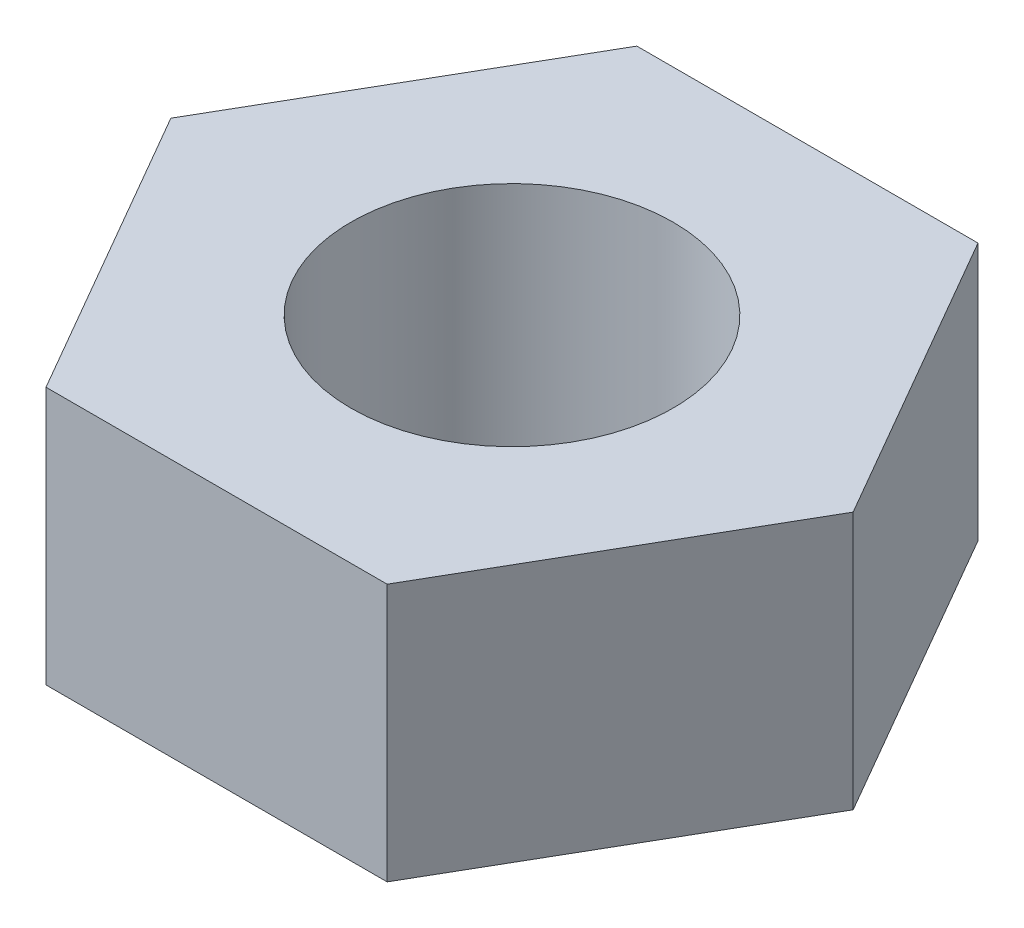
ISO-10303-21;
HEADER;
FILE_DESCRIPTION(('STEP AP214'),'2;1');
FILE_NAME('part.step','',(''),(''),'','','');
FILE_SCHEMA(('AUTOMOTIVE_DESIGN { 1 0 10303 214 1 1 1 1 }'));
ENDSEC;
DATA;
#1=APPLICATION_CONTEXT('core data for automotive mechanical design processes');
#2=APPLICATION_PROTOCOL_DEFINITION('international standard','automotive_design',2000,#1);
#3=PRODUCT_CONTEXT('',#1,'mechanical');
#4=PRODUCT('Part','Part','',(#3));
#5=PRODUCT_RELATED_PRODUCT_CATEGORY('part','',(#4));
#6=PRODUCT_DEFINITION_FORMATION('','',#4);
#7=PRODUCT_DEFINITION_CONTEXT('part definition',#1,'design');
#8=PRODUCT_DEFINITION('design','',#6,#7);
#9=PRODUCT_DEFINITION_SHAPE('','',#8);
#10=(LENGTH_UNIT() NAMED_UNIT(*) SI_UNIT(.MILLI.,.METRE.));
#11=(NAMED_UNIT(*) PLANE_ANGLE_UNIT() SI_UNIT($,.RADIAN.));
#12=(NAMED_UNIT(*) SI_UNIT($,.STERADIAN.) SOLID_ANGLE_UNIT());
#13=UNCERTAINTY_MEASURE_WITH_UNIT(LENGTH_MEASURE(1.E-05),#10,'distance_accuracy_value','');
#14=(GEOMETRIC_REPRESENTATION_CONTEXT(3) GLOBAL_UNCERTAINTY_ASSIGNED_CONTEXT((#13)) GLOBAL_UNIT_ASSIGNED_CONTEXT((#10,
#11,#12)) REPRESENTATION_CONTEXT('',''));
#15=CARTESIAN_POINT('',(0.,0.,0.));
#16=DIRECTION('',(0.,0.,1.));
#17=DIRECTION('',(1.,0.,0.));
#18=AXIS2_PLACEMENT_3D('',#15,#16,#17);
#19=CARTESIAN_POINT('',(-4.76313972081441,2.4,2.75));
#20=DIRECTION('',(0.,-1.,0.));
#21=DIRECTION('',(0.,0.,-1.));
#22=AXIS2_PLACEMENT_3D('',#19,#20,#21);
#23=PLANE('',#22);
#24=DIRECTION('',(1.,0.,0.));
#25=VECTOR('',#24,1.);
#26=CARTESIAN_POINT('',(-1.58771324027147,2.4,2.75));
#27=LINE('',#26,#25);
#28=CARTESIAN_POINT('',(-1.58771324027147,2.4,2.75));
#29=VERTEX_POINT('',#28);
#30=CARTESIAN_POINT('',(1.58771324027147,2.4,2.75));
#31=VERTEX_POINT('',#30);
#32=EDGE_CURVE('E117',#29,#31,#27,.T.);
#33=ORIENTED_EDGE('',*,*,#32,.T.);
#34=DIRECTION('',(0.5,0.,-0.866025403784439));
#35=VECTOR('',#34,1.);
#36=CARTESIAN_POINT('',(1.58771324027147,2.4,2.75));
#37=LINE('',#36,#35);
#38=CARTESIAN_POINT('',(3.17542648054294,2.4,0.));
#39=VERTEX_POINT('',#38);
#40=EDGE_CURVE('E98',#31,#39,#37,.T.);
#41=ORIENTED_EDGE('',*,*,#40,.T.);
#42=DIRECTION('',(-0.5,0.,-0.866025403784439));
#43=VECTOR('',#42,1.);
#44=CARTESIAN_POINT('',(3.17542648054294,2.4,0.));
#45=LINE('',#44,#43);
#46=CARTESIAN_POINT('',(1.58771324027147,2.4,-2.75));
#47=VERTEX_POINT('',#46);
#48=EDGE_CURVE('E120',#39,#47,#45,.T.);
#49=ORIENTED_EDGE('',*,*,#48,.T.);
#50=DIRECTION('',(-1.,0.,0.));
#51=VECTOR('',#50,1.);
#52=CARTESIAN_POINT('',(1.58771324027147,2.4,-2.75));
#53=LINE('',#52,#51);
#54=CARTESIAN_POINT('',(-1.58771324027147,2.4,-2.75));
#55=VERTEX_POINT('',#54);
#56=EDGE_CURVE('E122',#47,#55,#53,.T.);
#57=ORIENTED_EDGE('',*,*,#56,.T.);
#58=DIRECTION('',(-0.5,0.,0.866025403784439));
#59=VECTOR('',#58,1.);
#60=CARTESIAN_POINT('',(-1.58771324027147,2.4,-2.75));
#61=LINE('',#60,#59);
#62=CARTESIAN_POINT('',(-3.17542648054294,2.4,0.));
#63=VERTEX_POINT('',#62);
#64=EDGE_CURVE('E51',#55,#63,#61,.T.);
#65=ORIENTED_EDGE('',*,*,#64,.T.);
#66=DIRECTION('',(0.5,0.,0.866025403784439));
#67=VECTOR('',#66,1.);
#68=CARTESIAN_POINT('',(-3.17542648054294,2.4,0.));
#69=LINE('',#68,#67);
#70=EDGE_CURVE('E46',#63,#29,#69,.T.);
#71=ORIENTED_EDGE('',*,*,#70,.T.);
#72=EDGE_LOOP('',(#33,#41,#49,#57,#65,#71));
#73=FACE_BOUND('',#72,.T.);
#74=CARTESIAN_POINT('',(0.,2.4,0.));
#75=DIRECTION('',(0.,1.,0.));
#76=DIRECTION('',(0.,0.,1.));
#77=AXIS2_PLACEMENT_3D('',#74,#75,#76);
#78=CIRCLE('',#77,1.5);
#79=CARTESIAN_POINT('',(0.,2.4,1.5));
#80=VERTEX_POINT('',#79);
#81=EDGE_CURVE('E103',#80,#80,#78,.T.);
#82=ORIENTED_EDGE('',*,*,#81,.F.);
#83=EDGE_LOOP('',(#82));
#84=FACE_BOUND('',#83,.T.);
#85=ADVANCED_FACE('F31',(#73,#84),#23,.F.);
#86=CARTESIAN_POINT('',(-4.76313972081441,0.,2.75));
#87=DIRECTION('',(0.,-1.,0.));
#88=DIRECTION('',(0.,0.,-1.));
#89=AXIS2_PLACEMENT_3D('',#86,#87,#88);
#90=PLANE('',#89);
#91=DIRECTION('',(1.,0.,0.));
#92=VECTOR('',#91,1.);
#93=CARTESIAN_POINT('',(-1.58771324027147,0.,2.75));
#94=LINE('',#93,#92);
#95=CARTESIAN_POINT('',(-1.58771324027147,0.,2.75));
#96=VERTEX_POINT('',#95);
#97=CARTESIAN_POINT('',(1.58771324027147,0.,2.75));
#98=VERTEX_POINT('',#97);
#99=EDGE_CURVE('E89',#96,#98,#94,.T.);
#100=ORIENTED_EDGE('',*,*,#99,.F.);
#101=DIRECTION('',(0.5,0.,0.866025403784439));
#102=VECTOR('',#101,1.);
#103=CARTESIAN_POINT('',(-3.17542648054294,0.,0.));
#104=LINE('',#103,#102);
#105=CARTESIAN_POINT('',(-3.17542648054294,0.,0.));
#106=VERTEX_POINT('',#105);
#107=EDGE_CURVE('E115',#106,#96,#104,.T.);
#108=ORIENTED_EDGE('',*,*,#107,.F.);
#109=DIRECTION('',(-0.5,0.,0.866025403784439));
#110=VECTOR('',#109,1.);
#111=CARTESIAN_POINT('',(-1.58771324027147,0.,-2.75));
#112=LINE('',#111,#110);
#113=CARTESIAN_POINT('',(-1.58771324027147,0.,-2.75));
#114=VERTEX_POINT('',#113);
#115=EDGE_CURVE('E113',#114,#106,#112,.T.);
#116=ORIENTED_EDGE('',*,*,#115,.F.);
#117=DIRECTION('',(-1.,0.,0.));
#118=VECTOR('',#117,1.);
#119=CARTESIAN_POINT('',(1.58771324027147,0.,-2.75));
#120=LINE('',#119,#118);
#121=CARTESIAN_POINT('',(1.58771324027147,0.,-2.75));
#122=VERTEX_POINT('',#121);
#123=EDGE_CURVE('E111',#122,#114,#120,.T.);
#124=ORIENTED_EDGE('',*,*,#123,.F.);
#125=DIRECTION('',(-0.5,0.,-0.866025403784439));
#126=VECTOR('',#125,1.);
#127=CARTESIAN_POINT('',(3.17542648054294,0.,0.));
#128=LINE('',#127,#126);
#129=CARTESIAN_POINT('',(3.17542648054294,0.,0.));
#130=VERTEX_POINT('',#129);
#131=EDGE_CURVE('E91',#130,#122,#128,.T.);
#132=ORIENTED_EDGE('',*,*,#131,.F.);
#133=DIRECTION('',(0.5,0.,-0.866025403784439));
#134=VECTOR('',#133,1.);
#135=CARTESIAN_POINT('',(1.58771324027147,0.,2.75));
#136=LINE('',#135,#134);
#137=EDGE_CURVE('E84',#98,#130,#136,.T.);
#138=ORIENTED_EDGE('',*,*,#137,.F.);
#139=EDGE_LOOP('',(#100,#108,#116,#124,#132,#138));
#140=FACE_BOUND('',#139,.T.);
#141=CARTESIAN_POINT('',(0.,0.,0.));
#142=DIRECTION('',(0.,1.,0.));
#143=DIRECTION('',(0.,0.,1.));
#144=AXIS2_PLACEMENT_3D('',#141,#142,#143);
#145=CIRCLE('',#144,1.5);
#146=CARTESIAN_POINT('',(0.,0.,1.5));
#147=VERTEX_POINT('',#146);
#148=EDGE_CURVE('E106',#147,#147,#145,.T.);
#149=ORIENTED_EDGE('',*,*,#148,.T.);
#150=EDGE_LOOP('',(#149));
#151=FACE_BOUND('',#150,.T.);
#152=ADVANCED_FACE('F85',(#140,#151),#90,.T.);
#153=CARTESIAN_POINT('',(-1.58771324027147,2.4,2.75));
#154=DIRECTION('',(0.,0.,-1.));
#155=DIRECTION('',(-1.,0.,0.));
#156=AXIS2_PLACEMENT_3D('',#153,#154,#155);
#157=PLANE('',#156);
#158=ORIENTED_EDGE('',*,*,#99,.T.);
#159=DIRECTION('',(0.,-1.,0.));
#160=VECTOR('',#159,1.);
#161=CARTESIAN_POINT('',(1.58771324027147,2.4,2.75));
#162=LINE('',#161,#160);
#163=EDGE_CURVE('E11',#31,#98,#162,.T.);
#164=ORIENTED_EDGE('',*,*,#163,.F.);
#165=ORIENTED_EDGE('',*,*,#32,.F.);
#166=DIRECTION('',(0.,-1.,0.));
#167=VECTOR('',#166,1.);
#168=CARTESIAN_POINT('',(-1.58771324027147,2.4,2.75));
#169=LINE('',#168,#167);
#170=EDGE_CURVE('E102',#29,#96,#169,.T.);
#171=ORIENTED_EDGE('',*,*,#170,.T.);
#172=EDGE_LOOP('',(#158,#164,#165,#171));
#173=FACE_BOUND('',#172,.T.);
#174=ADVANCED_FACE('F33',(#173),#157,.F.);
#175=CARTESIAN_POINT('',(1.58771324027147,2.4,2.75));
#176=DIRECTION('',(-0.866025403784439,0.,-0.5));
#177=DIRECTION('',(-0.5,0.,0.866025403784439));
#178=AXIS2_PLACEMENT_3D('',#175,#176,#177);
#179=PLANE('',#178);
#180=ORIENTED_EDGE('',*,*,#137,.T.);
#181=DIRECTION('',(0.,-1.,0.));
#182=VECTOR('',#181,1.);
#183=CARTESIAN_POINT('',(3.17542648054294,2.4,0.));
#184=LINE('',#183,#182);
#185=EDGE_CURVE('E39',#39,#130,#184,.T.);
#186=ORIENTED_EDGE('',*,*,#185,.F.);
#187=ORIENTED_EDGE('',*,*,#40,.F.);
#188=ORIENTED_EDGE('',*,*,#163,.T.);
#189=EDGE_LOOP('',(#180,#186,#187,#188));
#190=FACE_BOUND('',#189,.T.);
#191=ADVANCED_FACE('F97',(#190),#179,.F.);
#192=CARTESIAN_POINT('',(3.17542648054294,2.4,0.));
#193=DIRECTION('',(-0.866025403784439,0.,0.5));
#194=DIRECTION('',(0.5,0.,0.866025403784439));
#195=AXIS2_PLACEMENT_3D('',#192,#193,#194);
#196=PLANE('',#195);
#197=ORIENTED_EDGE('',*,*,#131,.T.);
#198=DIRECTION('',(0.,-1.,0.));
#199=VECTOR('',#198,1.);
#200=CARTESIAN_POINT('',(1.58771324027147,2.4,-2.75));
#201=LINE('',#200,#199);
#202=EDGE_CURVE('E133',#47,#122,#201,.T.);
#203=ORIENTED_EDGE('',*,*,#202,.F.);
#204=ORIENTED_EDGE('',*,*,#48,.F.);
#205=ORIENTED_EDGE('',*,*,#185,.T.);
#206=EDGE_LOOP('',(#197,#203,#204,#205));
#207=FACE_BOUND('',#206,.T.);
#208=ADVANCED_FACE('F137',(#207),#196,.F.);
#209=CARTESIAN_POINT('',(1.58771324027147,2.4,-2.75));
#210=DIRECTION('',(0.,0.,1.));
#211=DIRECTION('',(1.,0.,0.));
#212=AXIS2_PLACEMENT_3D('',#209,#210,#211);
#213=PLANE('',#212);
#214=ORIENTED_EDGE('',*,*,#123,.T.);
#215=DIRECTION('',(0.,-1.,0.));
#216=VECTOR('',#215,1.);
#217=CARTESIAN_POINT('',(-1.58771324027147,2.4,-2.75));
#218=LINE('',#217,#216);
#219=EDGE_CURVE('E130',#55,#114,#218,.T.);
#220=ORIENTED_EDGE('',*,*,#219,.F.);
#221=ORIENTED_EDGE('',*,*,#56,.F.);
#222=ORIENTED_EDGE('',*,*,#202,.T.);
#223=EDGE_LOOP('',(#214,#220,#221,#222));
#224=FACE_BOUND('',#223,.T.);
#225=ADVANCED_FACE('F143',(#224),#213,.F.);
#226=CARTESIAN_POINT('',(-1.58771324027147,2.4,-2.75));
#227=DIRECTION('',(0.866025403784439,0.,0.5));
#228=DIRECTION('',(0.5,0.,-0.866025403784439));
#229=AXIS2_PLACEMENT_3D('',#226,#227,#228);
#230=PLANE('',#229);
#231=ORIENTED_EDGE('',*,*,#115,.T.);
#232=DIRECTION('',(0.,-1.,0.));
#233=VECTOR('',#232,1.);
#234=CARTESIAN_POINT('',(-3.17542648054294,2.4,0.));
#235=LINE('',#234,#233);
#236=EDGE_CURVE('E127',#63,#106,#235,.T.);
#237=ORIENTED_EDGE('',*,*,#236,.F.);
#238=ORIENTED_EDGE('',*,*,#64,.F.);
#239=ORIENTED_EDGE('',*,*,#219,.T.);
#240=EDGE_LOOP('',(#231,#237,#238,#239));
#241=FACE_BOUND('',#240,.T.);
#242=ADVANCED_FACE('F146',(#241),#230,.F.);
#243=CARTESIAN_POINT('',(-3.17542648054294,2.4,0.));
#244=DIRECTION('',(0.866025403784439,0.,-0.5));
#245=DIRECTION('',(-0.5,0.,-0.866025403784439));
#246=AXIS2_PLACEMENT_3D('',#243,#244,#245);
#247=PLANE('',#246);
#248=ORIENTED_EDGE('',*,*,#107,.T.);
#249=ORIENTED_EDGE('',*,*,#170,.F.);
#250=ORIENTED_EDGE('',*,*,#70,.F.);
#251=ORIENTED_EDGE('',*,*,#236,.T.);
#252=EDGE_LOOP('',(#248,#249,#250,#251));
#253=FACE_BOUND('',#252,.T.);
#254=ADVANCED_FACE('F148',(#253),#247,.F.);
#255=CARTESIAN_POINT('',(0.,2.4,0.));
#256=DIRECTION('',(0.,-1.,0.));
#257=DIRECTION('',(0.,0.,-1.));
#258=AXIS2_PLACEMENT_3D('',#255,#256,#257);
#259=CYLINDRICAL_SURFACE('',#258,1.5);
#260=ORIENTED_EDGE('',*,*,#81,.T.);
#261=EDGE_LOOP('',(#260));
#262=FACE_BOUND('',#261,.T.);
#263=ORIENTED_EDGE('',*,*,#148,.F.);
#264=EDGE_LOOP('',(#263));
#265=FACE_BOUND('',#264,.T.);
#266=ADVANCED_FACE('F150',(#262,#265),#259,.F.);
#267=CLOSED_SHELL('',(#85,#152,#174,#191,#208,#225,#242,#254,#266));
#268=MANIFOLD_SOLID_BREP('B2',#267);
#269=ADVANCED_BREP_SHAPE_REPRESENTATION('',(#18,#268),#14);
#270=SHAPE_DEFINITION_REPRESENTATION(#9,#269);
ENDSEC;
END-ISO-10303-21;
